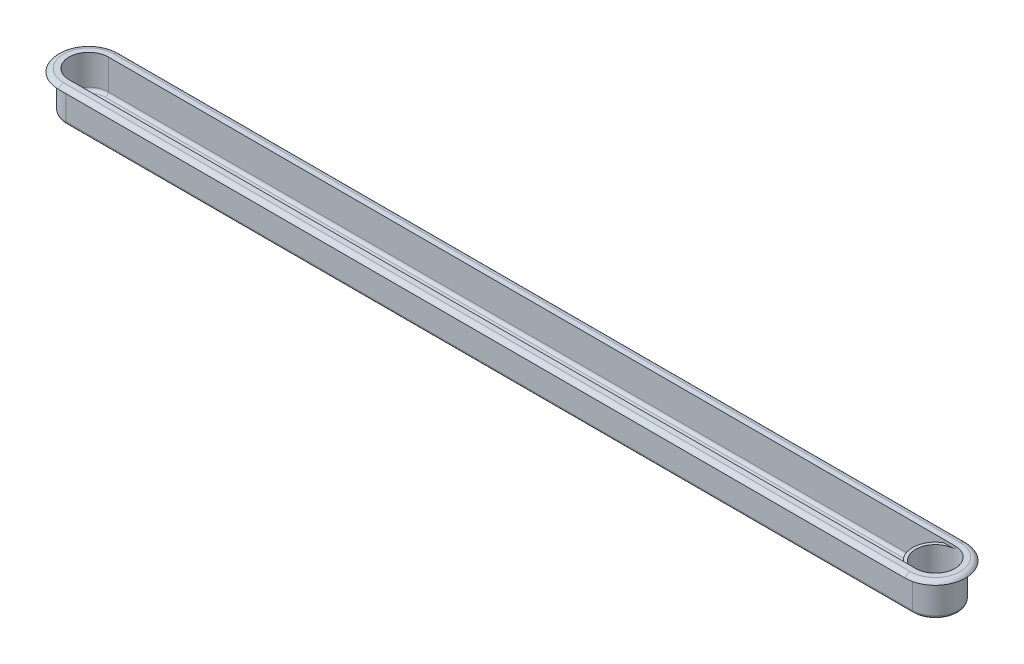
ISO-10303-21;
HEADER;
FILE_DESCRIPTION(('STEP AP214'),'2;1');
FILE_NAME('part.step','',(''),(''),'','','');
FILE_SCHEMA(('AUTOMOTIVE_DESIGN { 1 0 10303 214 1 1 1 1 }'));
ENDSEC;
DATA;
#1=APPLICATION_CONTEXT('core data for automotive mechanical design processes');
#2=APPLICATION_PROTOCOL_DEFINITION('international standard','automotive_design',2000,#1);
#3=PRODUCT_CONTEXT('',#1,'mechanical');
#4=PRODUCT('Part','Part','',(#3));
#5=PRODUCT_RELATED_PRODUCT_CATEGORY('part','',(#4));
#6=PRODUCT_DEFINITION_FORMATION('','',#4);
#7=PRODUCT_DEFINITION_CONTEXT('part definition',#1,'design');
#8=PRODUCT_DEFINITION('design','',#6,#7);
#9=PRODUCT_DEFINITION_SHAPE('','',#8);
#10=(LENGTH_UNIT() NAMED_UNIT(*) SI_UNIT(.MILLI.,.METRE.));
#11=(NAMED_UNIT(*) PLANE_ANGLE_UNIT() SI_UNIT($,.RADIAN.));
#12=(NAMED_UNIT(*) SI_UNIT($,.STERADIAN.) SOLID_ANGLE_UNIT());
#13=UNCERTAINTY_MEASURE_WITH_UNIT(LENGTH_MEASURE(1.E-05),#10,'distance_accuracy_value','');
#14=(GEOMETRIC_REPRESENTATION_CONTEXT(3) GLOBAL_UNCERTAINTY_ASSIGNED_CONTEXT((#13)) GLOBAL_UNIT_ASSIGNED_CONTEXT((#10,
#11,#12)) REPRESENTATION_CONTEXT('',''));
#15=CARTESIAN_POINT('',(0.,0.,0.));
#16=DIRECTION('',(0.,0.,1.));
#17=DIRECTION('',(1.,0.,0.));
#18=AXIS2_PLACEMENT_3D('',#15,#16,#17);
#19=CARTESIAN_POINT('',(140.,11.5,0.));
#20=DIRECTION('',(0.,1.,0.));
#21=DIRECTION('',(0.,0.,1.));
#22=AXIS2_PLACEMENT_3D('',#19,#20,#21);
#23=PLANE('',#22);
#24=CARTESIAN_POINT('',(140.,11.5,0.));
#25=DIRECTION('',(0.,-1.,0.));
#26=DIRECTION('',(0.,0.,1.));
#27=AXIS2_PLACEMENT_3D('',#24,#25,#26);
#28=CIRCLE('',#27,7.50000000000001);
#29=CARTESIAN_POINT('',(136.258342613226,11.5,6.49999999999997));
#30=VERTEX_POINT('',#29);
#31=CARTESIAN_POINT('',(136.258342613226,11.5,-6.49999999999997));
#32=VERTEX_POINT('',#31);
#33=EDGE_CURVE('E269',#30,#32,#28,.T.);
#34=ORIENTED_EDGE('',*,*,#33,.F.);
#35=DIRECTION('',(1.,0.,0.));
#36=VECTOR('',#35,1.);
#37=CARTESIAN_POINT('',(140.,11.5,6.5));
#38=LINE('',#37,#36);
#39=CARTESIAN_POINT('',(140.,11.5,6.5));
#40=VERTEX_POINT('',#39);
#41=EDGE_CURVE('E242',#30,#40,#38,.T.);
#42=ORIENTED_EDGE('',*,*,#41,.T.);
#43=CARTESIAN_POINT('',(140.,11.5,0.));
#44=DIRECTION('',(0.,1.,0.));
#45=DIRECTION('',(0.,0.,1.));
#46=AXIS2_PLACEMENT_3D('',#43,#44,#45);
#47=CIRCLE('',#46,6.49999999999999);
#48=CARTESIAN_POINT('',(140.,11.5,-6.49999999999997));
#49=VERTEX_POINT('',#48);
#50=EDGE_CURVE('E265',#49,#40,#47,.T.);
#51=ORIENTED_EDGE('',*,*,#50,.F.);
#52=DIRECTION('',(-1.,0.,0.));
#53=VECTOR('',#52,1.);
#54=CARTESIAN_POINT('',(136.258342613226,11.5,-6.49999999999997));
#55=LINE('',#54,#53);
#56=EDGE_CURVE('E233',#49,#32,#55,.T.);
#57=ORIENTED_EDGE('',*,*,#56,.T.);
#58=EDGE_LOOP('',(#34,#42,#51,#57));
#59=FACE_BOUND('',#58,.T.);
#60=ADVANCED_FACE('F37',(#59),#23,.T.);
#61=CARTESIAN_POINT('',(-140.,11.5,0.));
#62=DIRECTION('',(0.,-1.,0.));
#63=DIRECTION('',(0.,0.,-1.));
#64=AXIS2_PLACEMENT_3D('',#61,#62,#63);
#65=CYLINDRICAL_SURFACE('',#64,6.49999999999997);
#66=DIRECTION('',(0.,-1.,0.));
#67=VECTOR('',#66,1.);
#68=CARTESIAN_POINT('',(-140.,11.5,6.49999999999997));
#69=LINE('',#68,#67);
#70=CARTESIAN_POINT('',(-140.,12.5,6.49999999999997));
#71=VERTEX_POINT('',#70);
#72=CARTESIAN_POINT('',(-140.,2.5,6.49999999999997));
#73=VERTEX_POINT('',#72);
#74=EDGE_CURVE('E283',#71,#73,#69,.T.);
#75=ORIENTED_EDGE('',*,*,#74,.T.);
#76=CARTESIAN_POINT('',(-140.,2.5,0.));
#77=DIRECTION('',(0.,1.,0.));
#78=DIRECTION('',(0.,0.,1.));
#79=AXIS2_PLACEMENT_3D('',#76,#77,#78);
#80=CIRCLE('',#79,6.49999999999997);
#81=CARTESIAN_POINT('',(-140.,2.5,-6.49999999999997));
#82=VERTEX_POINT('',#81);
#83=EDGE_CURVE('E47',#73,#82,#80,.F.);
#84=ORIENTED_EDGE('',*,*,#83,.T.);
#85=DIRECTION('',(0.,-1.,0.));
#86=VECTOR('',#85,1.);
#87=CARTESIAN_POINT('',(-140.,11.5,-6.49999999999997));
#88=LINE('',#87,#86);
#89=CARTESIAN_POINT('',(-140.,12.5,-6.49999999999997));
#90=VERTEX_POINT('',#89);
#91=EDGE_CURVE('E272',#90,#82,#88,.T.);
#92=ORIENTED_EDGE('',*,*,#91,.F.);
#93=CARTESIAN_POINT('',(-140.,12.5,0.));
#94=DIRECTION('',(0.,1.,0.));
#95=DIRECTION('',(0.,0.,1.));
#96=AXIS2_PLACEMENT_3D('',#93,#94,#95);
#97=CIRCLE('',#96,6.49999999999997);
#98=EDGE_CURVE('E229',#90,#71,#97,.T.);
#99=ORIENTED_EDGE('',*,*,#98,.T.);
#100=EDGE_LOOP('',(#75,#84,#92,#99));
#101=FACE_BOUND('',#100,.T.);
#102=ADVANCED_FACE('F390',(#101),#65,.F.);
#103=CARTESIAN_POINT('',(-140.,11.5,6.49999999999997));
#104=DIRECTION('',(0.,0.,-1.));
#105=DIRECTION('',(-1.,0.,0.));
#106=AXIS2_PLACEMENT_3D('',#103,#104,#105);
#107=PLANE('',#106);
#108=DIRECTION('',(0.,-1.,0.));
#109=VECTOR('',#108,1.);
#110=CARTESIAN_POINT('',(136.258342613226,11.5,6.49999999999997));
#111=LINE('',#110,#109);
#112=CARTESIAN_POINT('',(136.258342613226,2.5,6.49999999999997));
#113=VERTEX_POINT('',#112);
#114=EDGE_CURVE('E280',#30,#113,#111,.T.);
#115=ORIENTED_EDGE('',*,*,#114,.T.);
#116=DIRECTION('',(1.,0.,0.));
#117=VECTOR('',#116,1.);
#118=CARTESIAN_POINT('',(-140.,2.5,6.49999999999997));
#119=LINE('',#118,#117);
#120=EDGE_CURVE('E477',#113,#73,#119,.F.);
#121=ORIENTED_EDGE('',*,*,#120,.T.);
#122=ORIENTED_EDGE('',*,*,#74,.F.);
#123=DIRECTION('',(1.,0.,0.));
#124=VECTOR('',#123,1.);
#125=CARTESIAN_POINT('',(-140.,12.5,6.49999999999997));
#126=LINE('',#125,#124);
#127=CARTESIAN_POINT('',(140.,12.5,6.5));
#128=VERTEX_POINT('',#127);
#129=EDGE_CURVE('E232',#71,#128,#126,.T.);
#130=ORIENTED_EDGE('',*,*,#129,.T.);
#131=DIRECTION('',(0.,-1.,0.));
#132=VECTOR('',#131,1.);
#133=CARTESIAN_POINT('',(140.,12.5,6.5));
#134=LINE('',#133,#132);
#135=EDGE_CURVE('E251',#128,#40,#134,.T.);
#136=ORIENTED_EDGE('',*,*,#135,.T.);
#137=ORIENTED_EDGE('',*,*,#41,.F.);
#138=EDGE_LOOP('',(#115,#121,#122,#130,#136,#137));
#139=FACE_BOUND('',#138,.T.);
#140=ADVANCED_FACE('F384',(#139),#107,.T.);
#141=CARTESIAN_POINT('',(140.,11.5,0.));
#142=DIRECTION('',(0.,-1.,0.));
#143=DIRECTION('',(0.,0.,-1.));
#144=AXIS2_PLACEMENT_3D('',#141,#142,#143);
#145=CYLINDRICAL_SURFACE('',#144,7.50000000000001);
#146=CARTESIAN_POINT('',(140.,1.5,0.));
#147=DIRECTION('',(0.,-1.,0.));
#148=DIRECTION('',(0.,0.,1.));
#149=AXIS2_PLACEMENT_3D('',#146,#147,#148);
#150=CIRCLE('',#149,7.50000000000001);
#151=CARTESIAN_POINT('',(134.900980486407,1.5,5.49999999999997));
#152=VERTEX_POINT('',#151);
#153=CARTESIAN_POINT('',(134.900980486407,1.5,-5.49999999999996));
#154=VERTEX_POINT('',#153);
#155=EDGE_CURVE('E268',#152,#154,#150,.T.);
#156=ORIENTED_EDGE('',*,*,#155,.F.);
#157=CARTESIAN_POINT('',(134.900980486407,1.5,5.49999999999997));
#158=CARTESIAN_POINT('',(134.946952291994,1.50002003650712,5.54262898673052));
#159=CARTESIAN_POINT('',(134.993445189555,1.50272504794038,5.58465170248606));
#160=CARTESIAN_POINT('',(135.087137466338,1.51320124060883,5.66724411827812));
#161=CARTESIAN_POINT('',(135.134336734867,1.5209716360291,5.70781404266275));
#162=CARTESIAN_POINT('',(135.229652092631,1.54138887863084,5.78771940563766));
#163=CARTESIAN_POINT('',(135.277772527232,1.55408944555912,5.82703589323914));
#164=CARTESIAN_POINT('',(135.374035633167,1.58420334133465,5.90374879192079));
#165=CARTESIAN_POINT('',(135.422178302356,1.60161628392711,5.94114536007041));
#166=CARTESIAN_POINT('',(135.54894823866,1.65380713672029,6.0372056326595));
#167=CARTESIAN_POINT('',(135.627338781558,1.69256190836863,6.0941390696333));
#168=CARTESIAN_POINT('',(135.742123230162,1.76077011162972,6.17435612255911));
#169=CARTESIAN_POINT('',(135.779838618358,1.78512153964702,6.200180588177));
#170=CARTESIAN_POINT('',(135.853906229219,1.83751917937633,6.24995092689734));
#171=CARTESIAN_POINT('',(135.890259488867,1.86556250390343,6.27389824488112));
#172=CARTESIAN_POINT('',(135.95671580884,1.9222579204163,6.31690046652232));
#173=CARTESIAN_POINT('',(135.987050884968,1.95044980439645,6.33619945161649));
#174=CARTESIAN_POINT('',(136.045361556525,2.01057411495382,6.3727559931852));
#175=CARTESIAN_POINT('',(136.07333189791,2.04251451286589,6.39000903645319));
#176=CARTESIAN_POINT('',(136.125950793258,2.11105235054671,6.42204815937765));
#177=CARTESIAN_POINT('',(136.150547181356,2.14770889223293,6.4367961915622));
#178=CARTESIAN_POINT('',(136.19373252189,2.22543123779643,6.46242652811217));
#179=CARTESIAN_POINT('',(136.212364240135,2.26646270597091,6.47333641001888));
#180=CARTESIAN_POINT('',(136.236737525985,2.33959183820559,6.48752609439693));
#181=CARTESIAN_POINT('',(136.244668422101,2.37068466011413,6.49211248537183));
#182=CARTESIAN_POINT('',(136.2527819256,2.41840287412194,6.49679660159349));
#183=CARTESIAN_POINT('',(136.254856878438,2.43461214394016,6.49799253767643));
#184=CARTESIAN_POINT('',(136.257641272943,2.46721063515719,6.49959631835286));
#185=CARTESIAN_POINT('',(136.258348608515,2.48360009507704,6.50000294743848));
#186=CARTESIAN_POINT('',(136.258342613226,2.5,6.49999999999997));
#187=B_SPLINE_CURVE_WITH_KNOTS('',3,(#157,#158,#159,#160,#161,#162,#163,#164,#165,#166,#167,
#168,#169,#170,#171,#172,#173,#174,#175,#176,#177,#178,#179,#180,#181,#182,#183,#184,#185,#186),
.UNSPECIFIED.,.F.,.F.,(4,2,2,2,2,2,2,2,2,2,2,2,2,2,4),(0.,0.187977721771527,0.375926288683914,
0.565983005401975,0.756024148638628,1.06786002140546,1.22310249235813,1.37822427185635,
1.51508684601939,1.65224592440766,1.7913311974802,1.92939567390316,2.02610998498491,
2.07519505258932,2.12435564986707),.UNSPECIFIED.);
#188=EDGE_CURVE('E371',#152,#113,#187,.T.);
#189=ORIENTED_EDGE('',*,*,#188,.T.);
#190=ORIENTED_EDGE('',*,*,#114,.F.);
#191=ORIENTED_EDGE('',*,*,#33,.T.);
#192=DIRECTION('',(0.,-1.,0.));
#193=VECTOR('',#192,1.);
#194=CARTESIAN_POINT('',(136.258342613226,11.5,-6.49999999999997));
#195=LINE('',#194,#193);
#196=CARTESIAN_POINT('',(136.258342613226,2.5,-6.49999999999997));
#197=VERTEX_POINT('',#196);
#198=EDGE_CURVE('E277',#32,#197,#195,.T.);
#199=ORIENTED_EDGE('',*,*,#198,.T.);
#200=CARTESIAN_POINT('',(136.258342613226,2.5,-6.49999999999997));
#201=CARTESIAN_POINT('',(136.25841792369,2.46928998727029,-6.5000374897446));
#202=CARTESIAN_POINT('',(136.255888256761,2.43869251118986,-6.49858745557396));
#203=CARTESIAN_POINT('',(136.246321658076,2.37881289931863,-6.49306922810718));
#204=CARTESIAN_POINT('',(136.239338686928,2.34951944826787,-6.48903237645842));
#205=CARTESIAN_POINT('',(136.219178495618,2.28502184992641,-6.47731019771003));
#206=CARTESIAN_POINT('',(136.204849642786,2.25031056964902,-6.46894118822808));
#207=CARTESIAN_POINT('',(136.171655542048,2.18387396589547,-6.44935308174181));
#208=CARTESIAN_POINT('',(136.152767197899,2.1521650274877,-6.43811945705791));
#209=CARTESIAN_POINT('',(136.099275543016,2.07328753220991,-6.40592035882745));
#210=CARTESIAN_POINT('',(136.062141130737,2.02857167273367,-6.38321296358818));
#211=CARTESIAN_POINT('',(135.983265212832,1.94595594862863,-6.33387946587137));
#212=CARTESIAN_POINT('',(135.941513154215,1.90807223981119,-6.3072443388297));
#213=CARTESIAN_POINT('',(135.860718751733,1.84249392703065,-6.25446888297825));
#214=CARTESIAN_POINT('',(135.821990622433,1.81411756673584,-6.22868331927618));
#215=CARTESIAN_POINT('',(135.743219115954,1.76133376599502,-6.17511905170644));
#216=CARTESIAN_POINT('',(135.703174846908,1.73692908645731,-6.14733898052949));
#217=CARTESIAN_POINT('',(135.581766442687,1.669141217856,-6.06127143496727));
#218=CARTESIAN_POINT('',(135.499178822603,1.63122428536937,-6.00029030743707));
#219=CARTESIAN_POINT('',(135.372920540882,1.58396201036063,-5.90281165735844));
#220=CARTESIAN_POINT('',(135.329376926202,1.5695961773513,-5.86842532842453));
#221=CARTESIAN_POINT('',(135.242391670056,1.54474546033107,-5.79812740143581));
#222=CARTESIAN_POINT('',(135.198950023901,1.53426039424039,-5.76221587502914));
#223=CARTESIAN_POINT('',(135.112716332713,1.51736237078483,-5.68925526954894));
#224=CARTESIAN_POINT('',(135.069921908525,1.51092373573531,-5.65221496027261));
#225=CARTESIAN_POINT('',(134.984934723896,1.50224867345782,-5.57694900722814));
#226=CARTESIAN_POINT('',(134.942742147279,1.50001350392638,-5.53872301217368));
#227=CARTESIAN_POINT('',(134.900980486407,1.5,-5.49999999999994));
#228=B_SPLINE_CURVE_WITH_KNOTS('',3,(#200,#201,#202,#203,#204,#205,#206,#207,#208,#209,#210,
#211,#212,#213,#214,#215,#216,#217,#218,#219,#220,#221,#222,#223,#224,#225,#226,#227),
.UNSPECIFIED.,.F.,.F.,(4,2,2,2,2,2,2,2,2,2,2,2,2,4),(0.,0.0918102616019271,0.182528665881996,
0.297306955274602,0.412679330468151,0.598844916694911,0.785445111116763,0.948706934309549,
1.11208176838381,1.43905073809234,1.61088519286762,1.78271158440525,1.95343629477279,
2.12421207864932),.UNSPECIFIED.);
#229=EDGE_CURVE('E364',#197,#154,#228,.T.);
#230=ORIENTED_EDGE('',*,*,#229,.T.);
#231=EDGE_LOOP('',(#156,#189,#190,#191,#199,#230));
#232=FACE_BOUND('',#231,.T.);
#233=ADVANCED_FACE('F378',(#232),#145,.T.);
#234=CARTESIAN_POINT('',(-140.,11.5,-6.49999999999997));
#235=DIRECTION('',(0.,0.,1.));
#236=DIRECTION('',(1.,0.,0.));
#237=AXIS2_PLACEMENT_3D('',#234,#235,#236);
#238=PLANE('',#237);
#239=ORIENTED_EDGE('',*,*,#91,.T.);
#240=DIRECTION('',(-1.,0.,0.));
#241=VECTOR('',#240,1.);
#242=CARTESIAN_POINT('',(136.258342613226,2.5,-6.49999999999997));
#243=LINE('',#242,#241);
#244=EDGE_CURVE('E11',#82,#197,#243,.F.);
#245=ORIENTED_EDGE('',*,*,#244,.T.);
#246=ORIENTED_EDGE('',*,*,#198,.F.);
#247=ORIENTED_EDGE('',*,*,#56,.F.);
#248=DIRECTION('',(0.,-1.,0.));
#249=VECTOR('',#248,1.);
#250=CARTESIAN_POINT('',(140.,12.5,-6.49999999999997));
#251=LINE('',#250,#249);
#252=CARTESIAN_POINT('',(140.,12.5,-6.49999999999997));
#253=VERTEX_POINT('',#252);
#254=EDGE_CURVE('E241',#253,#49,#251,.T.);
#255=ORIENTED_EDGE('',*,*,#254,.F.);
#256=DIRECTION('',(-1.,0.,0.));
#257=VECTOR('',#256,1.);
#258=CARTESIAN_POINT('',(140.,12.5,-6.49999999999997));
#259=LINE('',#258,#257);
#260=EDGE_CURVE('E238',#253,#90,#259,.T.);
#261=ORIENTED_EDGE('',*,*,#260,.T.);
#262=EDGE_LOOP('',(#239,#245,#246,#247,#255,#261));
#263=FACE_BOUND('',#262,.T.);
#264=ADVANCED_FACE('F383',(#263),#238,.T.);
#265=CARTESIAN_POINT('',(140.,11.5,0.));
#266=DIRECTION('',(0.,-1.,0.));
#267=DIRECTION('',(0.,0.,-1.));
#268=AXIS2_PLACEMENT_3D('',#265,#266,#267);
#269=CYLINDRICAL_SURFACE('',#268,6.49999999999999);
#270=ORIENTED_EDGE('',*,*,#50,.T.);
#271=ORIENTED_EDGE('',*,*,#135,.F.);
#272=CARTESIAN_POINT('',(140.,12.5,0.));
#273=DIRECTION('',(0.,1.,0.));
#274=DIRECTION('',(0.,0.,1.));
#275=AXIS2_PLACEMENT_3D('',#272,#273,#274);
#276=CIRCLE('',#275,6.49999999999999);
#277=EDGE_CURVE('E235',#128,#253,#276,.T.);
#278=ORIENTED_EDGE('',*,*,#277,.T.);
#279=ORIENTED_EDGE('',*,*,#254,.T.);
#280=EDGE_LOOP('',(#270,#271,#278,#279));
#281=FACE_BOUND('',#280,.T.);
#282=CARTESIAN_POINT('',(140.,1.5,0.));
#283=DIRECTION('',(0.,1.,0.));
#284=DIRECTION('',(0.,0.,1.));
#285=AXIS2_PLACEMENT_3D('',#282,#283,#284);
#286=CIRCLE('',#285,6.49999999999999);
#287=CARTESIAN_POINT('',(140.,1.5,6.5));
#288=VERTEX_POINT('',#287);
#289=EDGE_CURVE('E246',#288,#288,#286,.F.);
#290=ORIENTED_EDGE('',*,*,#289,.T.);
#291=EDGE_LOOP('',(#290));
#292=FACE_BOUND('',#291,.T.);
#293=ADVANCED_FACE('F484',(#281,#292),#269,.F.);
#294=CARTESIAN_POINT('',(-140.,1.5,0.));
#295=DIRECTION('',(0.,1.,0.));
#296=DIRECTION('',(0.,0.,1.));
#297=AXIS2_PLACEMENT_3D('',#294,#295,#296);
#298=PLANE('',#297);
#299=CARTESIAN_POINT('',(140.,1.5,0.));
#300=DIRECTION('',(0.,1.,0.));
#301=DIRECTION('',(0.,0.,1.));
#302=AXIS2_PLACEMENT_3D('',#299,#300,#301);
#303=CIRCLE('',#302,0.750000000000012);
#304=CARTESIAN_POINT('',(140.,1.5,0.750000000000029));
#305=VERTEX_POINT('',#304);
#306=EDGE_CURVE('E212',#305,#305,#303,.T.);
#307=ORIENTED_EDGE('',*,*,#306,.F.);
#308=EDGE_LOOP('',(#307));
#309=FACE_BOUND('',#308,.T.);
#310=ORIENTED_EDGE('',*,*,#289,.F.);
#311=EDGE_LOOP('',(#310));
#312=FACE_BOUND('',#311,.T.);
#313=ADVANCED_FACE('F402',(#309,#312),#298,.T.);
#314=CARTESIAN_POINT('',(-123.5,1.5,0.));
#315=DIRECTION('',(0.,1.,0.));
#316=DIRECTION('',(0.,0.,-1.));
#317=AXIS2_PLACEMENT_3D('',#314,#315,#316);
#318=CIRCLE('',#317,3.50000000000003);
#319=CARTESIAN_POINT('',(-123.5,1.5,-3.50000000000003));
#320=VERTEX_POINT('',#319);
#321=CARTESIAN_POINT('',(-123.5,1.5,3.50000000000003));
#322=VERTEX_POINT('',#321);
#323=EDGE_CURVE('E55',#320,#322,#318,.T.);
#324=ORIENTED_EDGE('',*,*,#323,.F.);
#325=DIRECTION('',(-1.,0.,0.));
#326=VECTOR('',#325,1.);
#327=CARTESIAN_POINT('',(-123.5,1.5,-3.50000000000003));
#328=LINE('',#327,#326);
#329=CARTESIAN_POINT('',(-103.5,1.5,-3.50000000000003));
#330=VERTEX_POINT('',#329);
#331=EDGE_CURVE('E206',#330,#320,#328,.T.);
#332=ORIENTED_EDGE('',*,*,#331,.F.);
#333=CARTESIAN_POINT('',(-103.5,1.5,0.));
#334=DIRECTION('',(0.,1.,0.));
#335=DIRECTION('',(0.,0.,-1.));
#336=AXIS2_PLACEMENT_3D('',#333,#334,#335);
#337=CIRCLE('',#336,3.50000000000003);
#338=CARTESIAN_POINT('',(-103.5,1.5,3.50000000000006));
#339=VERTEX_POINT('',#338);
#340=EDGE_CURVE('E209',#339,#330,#337,.T.);
#341=ORIENTED_EDGE('',*,*,#340,.F.);
#342=DIRECTION('',(1.,0.,0.));
#343=VECTOR('',#342,1.);
#344=CARTESIAN_POINT('',(-103.5,1.5,3.50000000000003));
#345=LINE('',#344,#343);
#346=EDGE_CURVE('E218',#322,#339,#345,.T.);
#347=ORIENTED_EDGE('',*,*,#346,.F.);
#348=EDGE_LOOP('',(#324,#332,#341,#347));
#349=FACE_BOUND('',#348,.T.);
#350=CARTESIAN_POINT('',(-140.,1.5,0.));
#351=DIRECTION('',(0.,1.,0.));
#352=DIRECTION('',(0.,0.,1.));
#353=AXIS2_PLACEMENT_3D('',#350,#351,#352);
#354=CIRCLE('',#353,5.49999999999997);
#355=CARTESIAN_POINT('',(-140.,1.5,-5.49999999999997));
#356=VERTEX_POINT('',#355);
#357=CARTESIAN_POINT('',(-140.,1.5,5.49999999999998));
#358=VERTEX_POINT('',#357);
#359=EDGE_CURVE('E359',#356,#358,#354,.T.);
#360=ORIENTED_EDGE('',*,*,#359,.T.);
#361=DIRECTION('',(1.,0.,0.));
#362=VECTOR('',#361,1.);
#363=CARTESIAN_POINT('',(136.258342613226,1.5,5.49999999999997));
#364=LINE('',#363,#362);
#365=EDGE_CURVE('E361',#358,#152,#364,.T.);
#366=ORIENTED_EDGE('',*,*,#365,.T.);
#367=ORIENTED_EDGE('',*,*,#155,.T.);
#368=DIRECTION('',(-1.,0.,0.));
#369=VECTOR('',#368,1.);
#370=CARTESIAN_POINT('',(-140.,1.5,-5.49999999999997));
#371=LINE('',#370,#369);
#372=EDGE_CURVE('E348',#154,#356,#371,.T.);
#373=ORIENTED_EDGE('',*,*,#372,.T.);
#374=EDGE_LOOP('',(#360,#366,#367,#373));
#375=FACE_BOUND('',#374,.T.);
#376=ADVANCED_FACE('F398',(#349,#375),#298,.T.);
#377=CARTESIAN_POINT('',(-140.,11.5,0.));
#378=DIRECTION('',(0.,1.,0.));
#379=DIRECTION('',(0.,0.,1.));
#380=AXIS2_PLACEMENT_3D('',#377,#378,#379);
#381=PLANE('',#380);
#382=CARTESIAN_POINT('',(-140.,11.5,0.));
#383=DIRECTION('',(0.,1.,0.));
#384=DIRECTION('',(0.,0.,1.));
#385=AXIS2_PLACEMENT_3D('',#382,#383,#384);
#386=CIRCLE('',#385,9.99999999999996);
#387=CARTESIAN_POINT('',(-140.,11.5,-9.99999999999996));
#388=VERTEX_POINT('',#387);
#389=CARTESIAN_POINT('',(-140.,11.5,9.99999999999996));
#390=VERTEX_POINT('',#389);
#391=EDGE_CURVE('E253',#388,#390,#386,.T.);
#392=ORIENTED_EDGE('',*,*,#391,.F.);
#393=DIRECTION('',(-1.,0.,0.));
#394=VECTOR('',#393,1.);
#395=CARTESIAN_POINT('',(-140.,11.5,-9.99999999999996));
#396=LINE('',#395,#394);
#397=CARTESIAN_POINT('',(140.,11.5,-9.99999999999996));
#398=VERTEX_POINT('',#397);
#399=EDGE_CURVE('E262',#398,#388,#396,.T.);
#400=ORIENTED_EDGE('',*,*,#399,.F.);
#401=CARTESIAN_POINT('',(140.,11.5,0.));
#402=DIRECTION('',(0.,1.,0.));
#403=DIRECTION('',(0.,0.,-1.));
#404=AXIS2_PLACEMENT_3D('',#401,#402,#403);
#405=CIRCLE('',#404,9.99999999999996);
#406=CARTESIAN_POINT('',(140.,11.5,9.99999999999998));
#407=VERTEX_POINT('',#406);
#408=EDGE_CURVE('E259',#407,#398,#405,.T.);
#409=ORIENTED_EDGE('',*,*,#408,.F.);
#410=DIRECTION('',(1.,0.,0.));
#411=VECTOR('',#410,1.);
#412=CARTESIAN_POINT('',(140.,11.5,9.99999999999996));
#413=LINE('',#412,#411);
#414=EDGE_CURVE('E256',#390,#407,#413,.T.);
#415=ORIENTED_EDGE('',*,*,#414,.F.);
#416=EDGE_LOOP('',(#392,#400,#409,#415));
#417=FACE_BOUND('',#416,.T.);
#418=DIRECTION('',(1.,0.,0.));
#419=VECTOR('',#418,1.);
#420=CARTESIAN_POINT('',(-140.,11.5,7.5));
#421=LINE('',#420,#419);
#422=CARTESIAN_POINT('',(-140.,11.5,7.5));
#423=VERTEX_POINT('',#422);
#424=CARTESIAN_POINT('',(140.,11.5,7.50000000000002));
#425=VERTEX_POINT('',#424);
#426=EDGE_CURVE('E295',#423,#425,#421,.T.);
#427=ORIENTED_EDGE('',*,*,#426,.T.);
#428=CARTESIAN_POINT('',(140.,11.5,0.));
#429=DIRECTION('',(0.,1.,0.));
#430=DIRECTION('',(0.,0.,1.));
#431=AXIS2_PLACEMENT_3D('',#428,#429,#430);
#432=CIRCLE('',#431,7.50000000000001);
#433=CARTESIAN_POINT('',(140.,11.5,-7.5));
#434=VERTEX_POINT('',#433);
#435=EDGE_CURVE('E286',#425,#434,#432,.T.);
#436=ORIENTED_EDGE('',*,*,#435,.T.);
#437=DIRECTION('',(-1.,0.,0.));
#438=VECTOR('',#437,1.);
#439=CARTESIAN_POINT('',(140.,11.5,-7.5));
#440=LINE('',#439,#438);
#441=CARTESIAN_POINT('',(-140.,11.5,-7.49999999999998));
#442=VERTEX_POINT('',#441);
#443=EDGE_CURVE('E289',#434,#442,#440,.T.);
#444=ORIENTED_EDGE('',*,*,#443,.T.);
#445=CARTESIAN_POINT('',(-140.,11.5,0.));
#446=DIRECTION('',(0.,1.,0.));
#447=DIRECTION('',(0.,0.,1.));
#448=AXIS2_PLACEMENT_3D('',#445,#446,#447);
#449=CIRCLE('',#448,7.5);
#450=EDGE_CURVE('E292',#442,#423,#449,.T.);
#451=ORIENTED_EDGE('',*,*,#450,.T.);
#452=EDGE_LOOP('',(#427,#436,#444,#451));
#453=FACE_BOUND('',#452,.T.);
#454=ADVANCED_FACE('F401',(#417,#453),#381,.F.);
#455=CARTESIAN_POINT('',(-140.,12.5,0.));
#456=DIRECTION('',(0.,1.,0.));
#457=DIRECTION('',(0.,0.,1.));
#458=AXIS2_PLACEMENT_3D('',#455,#456,#457);
#459=PLANE('',#458);
#460=DIRECTION('',(1.,0.,0.));
#461=VECTOR('',#460,1.);
#462=CARTESIAN_POINT('',(-140.,12.5,-8.26794919243109));
#463=LINE('',#462,#461);
#464=CARTESIAN_POINT('',(140.,12.5,-8.26794919243109));
#465=VERTEX_POINT('',#464);
#466=CARTESIAN_POINT('',(-140.,12.5,-8.26794919243109));
#467=VERTEX_POINT('',#466);
#468=EDGE_CURVE('E245',#465,#467,#463,.F.);
#469=ORIENTED_EDGE('',*,*,#468,.T.);
#470=CARTESIAN_POINT('',(-140.,12.5,0.));
#471=DIRECTION('',(0.,1.,0.));
#472=DIRECTION('',(0.,0.,1.));
#473=AXIS2_PLACEMENT_3D('',#470,#471,#472);
#474=CIRCLE('',#473,8.26794919243109);
#475=CARTESIAN_POINT('',(-140.,12.5,8.26794919243109));
#476=VERTEX_POINT('',#475);
#477=EDGE_CURVE('E317',#467,#476,#474,.T.);
#478=ORIENTED_EDGE('',*,*,#477,.T.);
#479=DIRECTION('',(-1.,0.,0.));
#480=VECTOR('',#479,1.);
#481=CARTESIAN_POINT('',(140.,12.5,8.26794919243109));
#482=LINE('',#481,#480);
#483=CARTESIAN_POINT('',(140.,12.5,8.2679491924311));
#484=VERTEX_POINT('',#483);
#485=EDGE_CURVE('E315',#476,#484,#482,.F.);
#486=ORIENTED_EDGE('',*,*,#485,.T.);
#487=CARTESIAN_POINT('',(140.,12.5,0.));
#488=DIRECTION('',(0.,1.,0.));
#489=DIRECTION('',(0.,0.,1.));
#490=AXIS2_PLACEMENT_3D('',#487,#488,#489);
#491=CIRCLE('',#490,8.26794919243109);
#492=EDGE_CURVE('E313',#484,#465,#491,.T.);
#493=ORIENTED_EDGE('',*,*,#492,.T.);
#494=EDGE_LOOP('',(#469,#478,#486,#493));
#495=FACE_BOUND('',#494,.T.);
#496=ORIENTED_EDGE('',*,*,#129,.F.);
#497=ORIENTED_EDGE('',*,*,#98,.F.);
#498=ORIENTED_EDGE('',*,*,#260,.F.);
#499=ORIENTED_EDGE('',*,*,#277,.F.);
#500=EDGE_LOOP('',(#496,#497,#498,#499));
#501=FACE_BOUND('',#500,.T.);
#502=ADVANCED_FACE('F407',(#495,#501),#459,.T.);
#503=CARTESIAN_POINT('',(-140.,0.,0.));
#504=DIRECTION('',(0.,1.,0.));
#505=DIRECTION('',(0.,0.,1.));
#506=AXIS2_PLACEMENT_3D('',#503,#504,#505);
#507=PLANE('',#506);
#508=CARTESIAN_POINT('',(140.,0.,0.));
#509=DIRECTION('',(0.,1.,0.));
#510=DIRECTION('',(0.,0.,1.));
#511=AXIS2_PLACEMENT_3D('',#508,#509,#510);
#512=CIRCLE('',#511,0.750000000000012);
#513=CARTESIAN_POINT('',(140.,0.,0.750000000000029));
#514=VERTEX_POINT('',#513);
#515=EDGE_CURVE('E219',#514,#514,#512,.T.);
#516=ORIENTED_EDGE('',*,*,#515,.T.);
#517=EDGE_LOOP('',(#516));
#518=FACE_BOUND('',#517,.T.);
#519=DIRECTION('',(-1.,0.,0.));
#520=VECTOR('',#519,1.);
#521=CARTESIAN_POINT('',(-123.5,0.,-3.50000000000003));
#522=LINE('',#521,#520);
#523=CARTESIAN_POINT('',(-103.5,0.,-3.50000000000003));
#524=VERTEX_POINT('',#523);
#525=CARTESIAN_POINT('',(-123.5,0.,-3.50000000000003));
#526=VERTEX_POINT('',#525);
#527=EDGE_CURVE('E196',#524,#526,#522,.T.);
#528=ORIENTED_EDGE('',*,*,#527,.T.);
#529=CARTESIAN_POINT('',(-123.5,0.,0.));
#530=DIRECTION('',(0.,1.,0.));
#531=DIRECTION('',(0.,0.,-1.));
#532=AXIS2_PLACEMENT_3D('',#529,#530,#531);
#533=CIRCLE('',#532,3.50000000000003);
#534=CARTESIAN_POINT('',(-123.5,0.,3.50000000000003));
#535=VERTEX_POINT('',#534);
#536=EDGE_CURVE('E190',#526,#535,#533,.T.);
#537=ORIENTED_EDGE('',*,*,#536,.T.);
#538=DIRECTION('',(1.,0.,0.));
#539=VECTOR('',#538,1.);
#540=CARTESIAN_POINT('',(-103.5,0.,3.50000000000003));
#541=LINE('',#540,#539);
#542=CARTESIAN_POINT('',(-103.5,0.,3.50000000000003));
#543=VERTEX_POINT('',#542);
#544=EDGE_CURVE('E199',#535,#543,#541,.T.);
#545=ORIENTED_EDGE('',*,*,#544,.T.);
#546=CARTESIAN_POINT('',(-103.5,0.,0.));
#547=DIRECTION('',(0.,1.,0.));
#548=DIRECTION('',(0.,0.,-1.));
#549=AXIS2_PLACEMENT_3D('',#546,#547,#548);
#550=CIRCLE('',#549,3.50000000000003);
#551=EDGE_CURVE('E63',#543,#524,#550,.T.);
#552=ORIENTED_EDGE('',*,*,#551,.T.);
#553=EDGE_LOOP('',(#528,#537,#545,#552));
#554=FACE_BOUND('',#553,.T.);
#555=DIRECTION('',(1.,0.,0.));
#556=VECTOR('',#555,1.);
#557=CARTESIAN_POINT('',(-140.,0.,6.5));
#558=LINE('',#557,#556);
#559=CARTESIAN_POINT('',(140.,0.,6.50000000000002));
#560=VERTEX_POINT('',#559);
#561=CARTESIAN_POINT('',(-140.,0.,6.5));
#562=VERTEX_POINT('',#561);
#563=EDGE_CURVE('E337',#560,#562,#558,.F.);
#564=ORIENTED_EDGE('',*,*,#563,.T.);
#565=CARTESIAN_POINT('',(-140.,0.,0.));
#566=DIRECTION('',(0.,1.,0.));
#567=DIRECTION('',(0.,0.,1.));
#568=AXIS2_PLACEMENT_3D('',#565,#566,#567);
#569=CIRCLE('',#568,6.5);
#570=CARTESIAN_POINT('',(-140.,0.,-6.5));
#571=VERTEX_POINT('',#570);
#572=EDGE_CURVE('E339',#562,#571,#569,.F.);
#573=ORIENTED_EDGE('',*,*,#572,.T.);
#574=DIRECTION('',(-1.,0.,0.));
#575=VECTOR('',#574,1.);
#576=CARTESIAN_POINT('',(-140.,0.,-6.5));
#577=LINE('',#576,#575);
#578=CARTESIAN_POINT('',(140.,0.,-6.5));
#579=VERTEX_POINT('',#578);
#580=EDGE_CURVE('E333',#571,#579,#577,.F.);
#581=ORIENTED_EDGE('',*,*,#580,.T.);
#582=CARTESIAN_POINT('',(140.,0.,0.));
#583=DIRECTION('',(0.,1.,0.));
#584=DIRECTION('',(0.,0.,1.));
#585=AXIS2_PLACEMENT_3D('',#582,#583,#584);
#586=CIRCLE('',#585,6.5);
#587=EDGE_CURVE('E335',#579,#560,#586,.F.);
#588=ORIENTED_EDGE('',*,*,#587,.T.);
#589=EDGE_LOOP('',(#564,#573,#581,#588));
#590=FACE_BOUND('',#589,.T.);
#591=ADVANCED_FACE('F203',(#518,#554,#590),#507,.F.);
#592=CARTESIAN_POINT('',(-140.,1.5,7.5));
#593=DIRECTION('',(0.,0.,-1.));
#594=DIRECTION('',(-1.,0.,0.));
#595=AXIS2_PLACEMENT_3D('',#592,#593,#594);
#596=PLANE('',#595);
#597=DIRECTION('',(0.,-1.,0.));
#598=VECTOR('',#597,1.);
#599=CARTESIAN_POINT('',(-140.,1.5,7.5));
#600=LINE('',#599,#598);
#601=CARTESIAN_POINT('',(-140.,1.,7.5));
#602=VERTEX_POINT('',#601);
#603=EDGE_CURVE('E307',#423,#602,#600,.T.);
#604=ORIENTED_EDGE('',*,*,#603,.T.);
#605=DIRECTION('',(1.,0.,0.));
#606=VECTOR('',#605,1.);
#607=CARTESIAN_POINT('',(-140.,1.,7.5));
#608=LINE('',#607,#606);
#609=CARTESIAN_POINT('',(140.,1.,7.50000000000002));
#610=VERTEX_POINT('',#609);
#611=EDGE_CURVE('E342',#602,#610,#608,.T.);
#612=ORIENTED_EDGE('',*,*,#611,.T.);
#613=DIRECTION('',(0.,-1.,0.));
#614=VECTOR('',#613,1.);
#615=CARTESIAN_POINT('',(140.,1.5,7.50000000000002));
#616=LINE('',#615,#614);
#617=EDGE_CURVE('E304',#425,#610,#616,.T.);
#618=ORIENTED_EDGE('',*,*,#617,.F.);
#619=ORIENTED_EDGE('',*,*,#426,.F.);
#620=EDGE_LOOP('',(#604,#612,#618,#619));
#621=FACE_BOUND('',#620,.T.);
#622=ADVANCED_FACE('F406',(#621),#596,.F.);
#623=CARTESIAN_POINT('',(-140.,1.5,0.));
#624=DIRECTION('',(0.,-1.,0.));
#625=DIRECTION('',(0.,0.,-1.));
#626=AXIS2_PLACEMENT_3D('',#623,#624,#625);
#627=CYLINDRICAL_SURFACE('',#626,7.5);
#628=DIRECTION('',(0.,-1.,0.));
#629=VECTOR('',#628,1.);
#630=CARTESIAN_POINT('',(-140.,1.5,-7.5));
#631=LINE('',#630,#629);
#632=CARTESIAN_POINT('',(-140.,1.,-7.5));
#633=VERTEX_POINT('',#632);
#634=EDGE_CURVE('E298',#442,#633,#631,.T.);
#635=ORIENTED_EDGE('',*,*,#634,.T.);
#636=CARTESIAN_POINT('',(-140.,1.,0.));
#637=DIRECTION('',(0.,1.,0.));
#638=DIRECTION('',(0.,0.,1.));
#639=AXIS2_PLACEMENT_3D('',#636,#637,#638);
#640=CIRCLE('',#639,7.5);
#641=EDGE_CURVE('E320',#633,#602,#640,.T.);
#642=ORIENTED_EDGE('',*,*,#641,.T.);
#643=ORIENTED_EDGE('',*,*,#603,.F.);
#644=ORIENTED_EDGE('',*,*,#450,.F.);
#645=EDGE_LOOP('',(#635,#642,#643,#644));
#646=FACE_BOUND('',#645,.T.);
#647=ADVANCED_FACE('F413',(#646),#627,.T.);
#648=CARTESIAN_POINT('',(140.,1.5,-7.5));
#649=DIRECTION('',(0.,0.,1.));
#650=DIRECTION('',(1.,0.,0.));
#651=AXIS2_PLACEMENT_3D('',#648,#649,#650);
#652=PLANE('',#651);
#653=DIRECTION('',(0.,-1.,0.));
#654=VECTOR('',#653,1.);
#655=CARTESIAN_POINT('',(140.,1.5,-7.5));
#656=LINE('',#655,#654);
#657=CARTESIAN_POINT('',(140.,1.,-7.5));
#658=VERTEX_POINT('',#657);
#659=EDGE_CURVE('E301',#434,#658,#656,.T.);
#660=ORIENTED_EDGE('',*,*,#659,.T.);
#661=DIRECTION('',(-1.,0.,0.));
#662=VECTOR('',#661,1.);
#663=CARTESIAN_POINT('',(140.,1.,-7.5));
#664=LINE('',#663,#662);
#665=EDGE_CURVE('E346',#658,#633,#664,.T.);
#666=ORIENTED_EDGE('',*,*,#665,.T.);
#667=ORIENTED_EDGE('',*,*,#634,.F.);
#668=ORIENTED_EDGE('',*,*,#443,.F.);
#669=EDGE_LOOP('',(#660,#666,#667,#668));
#670=FACE_BOUND('',#669,.T.);
#671=ADVANCED_FACE('F409',(#670),#652,.F.);
#672=CARTESIAN_POINT('',(140.,1.5,0.));
#673=DIRECTION('',(0.,-1.,0.));
#674=DIRECTION('',(0.,0.,-1.));
#675=AXIS2_PLACEMENT_3D('',#672,#673,#674);
#676=CYLINDRICAL_SURFACE('',#675,7.5);
#677=ORIENTED_EDGE('',*,*,#617,.T.);
#678=CARTESIAN_POINT('',(140.,1.,0.));
#679=DIRECTION('',(0.,1.,0.));
#680=DIRECTION('',(0.,0.,1.));
#681=AXIS2_PLACEMENT_3D('',#678,#679,#680);
#682=CIRCLE('',#681,7.5);
#683=EDGE_CURVE('E344',#610,#658,#682,.T.);
#684=ORIENTED_EDGE('',*,*,#683,.T.);
#685=ORIENTED_EDGE('',*,*,#659,.F.);
#686=ORIENTED_EDGE('',*,*,#435,.F.);
#687=EDGE_LOOP('',(#677,#684,#685,#686));
#688=FACE_BOUND('',#687,.T.);
#689=ADVANCED_FACE('F412',(#688),#676,.T.);
#690=CARTESIAN_POINT('',(140.,10.5,0.));
#691=DIRECTION('',(0.,-1.,0.));
#692=DIRECTION('',(0.,0.,-1.));
#693=AXIS2_PLACEMENT_3D('',#690,#691,#692);
#694=TOROIDAL_SURFACE('',#693,8.26794919243109,2.);
#695=CARTESIAN_POINT('',(140.,10.5,8.26794919243101));
#696=DIRECTION('',(-1.,0.,0.));
#697=DIRECTION('',(0.,0.,1.));
#698=AXIS2_PLACEMENT_3D('',#695,#696,#697);
#699=CIRCLE('',#698,2.);
#700=EDGE_CURVE('E326',#407,#484,#699,.T.);
#701=ORIENTED_EDGE('',*,*,#700,.F.);
#702=ORIENTED_EDGE('',*,*,#408,.T.);
#703=CARTESIAN_POINT('',(140.,10.5,-8.26794919243107));
#704=DIRECTION('',(-1.,0.,0.));
#705=DIRECTION('',(0.,0.,1.));
#706=AXIS2_PLACEMENT_3D('',#703,#704,#705);
#707=CIRCLE('',#706,2.);
#708=EDGE_CURVE('E248',#465,#398,#707,.T.);
#709=ORIENTED_EDGE('',*,*,#708,.F.);
#710=ORIENTED_EDGE('',*,*,#492,.F.);
#711=EDGE_LOOP('',(#701,#702,#709,#710));
#712=FACE_BOUND('',#711,.T.);
#713=ADVANCED_FACE('F417',(#712),#694,.T.);
#714=CARTESIAN_POINT('',(-140.,10.5,-8.26794919243109));
#715=DIRECTION('',(-1.,0.,0.));
#716=DIRECTION('',(0.,0.,1.));
#717=AXIS2_PLACEMENT_3D('',#714,#715,#716);
#718=CYLINDRICAL_SURFACE('',#717,2.);
#719=ORIENTED_EDGE('',*,*,#708,.T.);
#720=ORIENTED_EDGE('',*,*,#399,.T.);
#721=CARTESIAN_POINT('',(-140.,10.5,-8.26794919243109));
#722=DIRECTION('',(-1.,0.,0.));
#723=DIRECTION('',(0.,0.,1.));
#724=AXIS2_PLACEMENT_3D('',#721,#722,#723);
#725=CIRCLE('',#724,2.);
#726=EDGE_CURVE('E323',#467,#388,#725,.T.);
#727=ORIENTED_EDGE('',*,*,#726,.F.);
#728=ORIENTED_EDGE('',*,*,#468,.F.);
#729=EDGE_LOOP('',(#719,#720,#727,#728));
#730=FACE_BOUND('',#729,.T.);
#731=ADVANCED_FACE('F433',(#730),#718,.T.);
#732=CARTESIAN_POINT('',(140.,10.5,8.26794919243109));
#733=DIRECTION('',(1.,0.,0.));
#734=DIRECTION('',(0.,0.,-1.));
#735=AXIS2_PLACEMENT_3D('',#732,#733,#734);
#736=CYLINDRICAL_SURFACE('',#735,2.);
#737=ORIENTED_EDGE('',*,*,#700,.T.);
#738=ORIENTED_EDGE('',*,*,#485,.F.);
#739=CARTESIAN_POINT('',(-140.,10.5,8.26794919243099));
#740=DIRECTION('',(-1.,0.,0.));
#741=DIRECTION('',(0.,0.,1.));
#742=AXIS2_PLACEMENT_3D('',#739,#740,#741);
#743=CIRCLE('',#742,2.);
#744=EDGE_CURVE('E321',#390,#476,#743,.T.);
#745=ORIENTED_EDGE('',*,*,#744,.F.);
#746=ORIENTED_EDGE('',*,*,#414,.T.);
#747=EDGE_LOOP('',(#737,#738,#745,#746));
#748=FACE_BOUND('',#747,.T.);
#749=ADVANCED_FACE('F429',(#748),#736,.T.);
#750=CARTESIAN_POINT('',(-140.,10.5,0.));
#751=DIRECTION('',(0.,-1.,0.));
#752=DIRECTION('',(0.,0.,-1.));
#753=AXIS2_PLACEMENT_3D('',#750,#751,#752);
#754=TOROIDAL_SURFACE('',#753,8.26794919243109,2.);
#755=ORIENTED_EDGE('',*,*,#726,.T.);
#756=ORIENTED_EDGE('',*,*,#391,.T.);
#757=ORIENTED_EDGE('',*,*,#744,.T.);
#758=ORIENTED_EDGE('',*,*,#477,.F.);
#759=EDGE_LOOP('',(#755,#756,#757,#758));
#760=FACE_BOUND('',#759,.T.);
#761=ADVANCED_FACE('F425',(#760),#754,.T.);
#762=CARTESIAN_POINT('',(140.,1.,0.));
#763=DIRECTION('',(0.,1.,0.));
#764=DIRECTION('',(0.,0.,1.));
#765=AXIS2_PLACEMENT_3D('',#762,#763,#764);
#766=TOROIDAL_SURFACE('',#765,6.5,1.);
#767=CARTESIAN_POINT('',(140.,1.,6.50000000000002));
#768=DIRECTION('',(-1.,0.,0.));
#769=DIRECTION('',(0.,0.,1.));
#770=AXIS2_PLACEMENT_3D('',#767,#768,#769);
#771=CIRCLE('',#770,1.);
#772=EDGE_CURVE('E353',#560,#610,#771,.T.);
#773=ORIENTED_EDGE('',*,*,#772,.F.);
#774=ORIENTED_EDGE('',*,*,#587,.F.);
#775=CARTESIAN_POINT('',(140.,1.,-6.49999999999998));
#776=DIRECTION('',(-1.,0.,0.));
#777=DIRECTION('',(0.,0.,1.));
#778=AXIS2_PLACEMENT_3D('',#775,#776,#777);
#779=CIRCLE('',#778,1.);
#780=EDGE_CURVE('E324',#658,#579,#779,.T.);
#781=ORIENTED_EDGE('',*,*,#780,.F.);
#782=ORIENTED_EDGE('',*,*,#683,.F.);
#783=EDGE_LOOP('',(#773,#774,#781,#782));
#784=FACE_BOUND('',#783,.T.);
#785=ADVANCED_FACE('F428',(#784),#766,.T.);
#786=CARTESIAN_POINT('',(140.,1.,-6.5));
#787=DIRECTION('',(-1.,0.,0.));
#788=DIRECTION('',(0.,0.,1.));
#789=AXIS2_PLACEMENT_3D('',#786,#787,#788);
#790=CYLINDRICAL_SURFACE('',#789,1.);
#791=ORIENTED_EDGE('',*,*,#780,.T.);
#792=ORIENTED_EDGE('',*,*,#580,.F.);
#793=CARTESIAN_POINT('',(-140.,1.,-6.5));
#794=DIRECTION('',(-1.,0.,0.));
#795=DIRECTION('',(0.,0.,1.));
#796=AXIS2_PLACEMENT_3D('',#793,#794,#795);
#797=CIRCLE('',#796,1.);
#798=EDGE_CURVE('E351',#633,#571,#797,.T.);
#799=ORIENTED_EDGE('',*,*,#798,.F.);
#800=ORIENTED_EDGE('',*,*,#665,.F.);
#801=EDGE_LOOP('',(#791,#792,#799,#800));
#802=FACE_BOUND('',#801,.T.);
#803=ADVANCED_FACE('F448',(#802),#790,.T.);
#804=CARTESIAN_POINT('',(-140.,1.,6.5));
#805=DIRECTION('',(1.,0.,0.));
#806=DIRECTION('',(0.,0.,-1.));
#807=AXIS2_PLACEMENT_3D('',#804,#805,#806);
#808=CYLINDRICAL_SURFACE('',#807,1.);
#809=ORIENTED_EDGE('',*,*,#772,.T.);
#810=ORIENTED_EDGE('',*,*,#611,.F.);
#811=CARTESIAN_POINT('',(-140.,1.,6.5));
#812=DIRECTION('',(-1.,0.,0.));
#813=DIRECTION('',(0.,0.,1.));
#814=AXIS2_PLACEMENT_3D('',#811,#812,#813);
#815=CIRCLE('',#814,1.);
#816=EDGE_CURVE('E349',#562,#602,#815,.T.);
#817=ORIENTED_EDGE('',*,*,#816,.F.);
#818=ORIENTED_EDGE('',*,*,#563,.F.);
#819=EDGE_LOOP('',(#809,#810,#817,#818));
#820=FACE_BOUND('',#819,.T.);
#821=ADVANCED_FACE('F444',(#820),#808,.T.);
#822=CARTESIAN_POINT('',(-140.,1.,0.));
#823=DIRECTION('',(0.,1.,0.));
#824=DIRECTION('',(0.,0.,1.));
#825=AXIS2_PLACEMENT_3D('',#822,#823,#824);
#826=TOROIDAL_SURFACE('',#825,6.5,1.);
#827=ORIENTED_EDGE('',*,*,#798,.T.);
#828=ORIENTED_EDGE('',*,*,#572,.F.);
#829=ORIENTED_EDGE('',*,*,#816,.T.);
#830=ORIENTED_EDGE('',*,*,#641,.F.);
#831=EDGE_LOOP('',(#827,#828,#829,#830));
#832=FACE_BOUND('',#831,.T.);
#833=ADVANCED_FACE('F441',(#832),#826,.T.);
#834=CARTESIAN_POINT('',(-140.,2.5,-5.49999999999997));
#835=DIRECTION('',(1.,0.,0.));
#836=DIRECTION('',(0.,0.,-1.));
#837=AXIS2_PLACEMENT_3D('',#834,#835,#836);
#838=CYLINDRICAL_SURFACE('',#837,1.);
#839=ORIENTED_EDGE('',*,*,#229,.F.);
#840=ORIENTED_EDGE('',*,*,#244,.F.);
#841=CARTESIAN_POINT('',(-140.,2.5,-5.49999999999997));
#842=DIRECTION('',(1.,0.,0.));
#843=DIRECTION('',(0.,0.,-1.));
#844=AXIS2_PLACEMENT_3D('',#841,#842,#843);
#845=CIRCLE('',#844,1.);
#846=EDGE_CURVE('E42',#356,#82,#845,.T.);
#847=ORIENTED_EDGE('',*,*,#846,.F.);
#848=ORIENTED_EDGE('',*,*,#372,.F.);
#849=EDGE_LOOP('',(#839,#840,#847,#848));
#850=FACE_BOUND('',#849,.T.);
#851=ADVANCED_FACE('F39',(#850),#838,.F.);
#852=CARTESIAN_POINT('',(-140.,2.5,0.));
#853=DIRECTION('',(0.,1.,0.));
#854=DIRECTION('',(0.,0.,1.));
#855=AXIS2_PLACEMENT_3D('',#852,#853,#854);
#856=TOROIDAL_SURFACE('',#855,5.49999999999997,1.);
#857=ORIENTED_EDGE('',*,*,#846,.T.);
#858=ORIENTED_EDGE('',*,*,#83,.F.);
#859=CARTESIAN_POINT('',(-140.,2.5,5.49999999999998));
#860=DIRECTION('',(-1.,0.,0.));
#861=DIRECTION('',(0.,0.,1.));
#862=AXIS2_PLACEMENT_3D('',#859,#860,#861);
#863=CIRCLE('',#862,1.);
#864=EDGE_CURVE('E225',#358,#73,#863,.T.);
#865=ORIENTED_EDGE('',*,*,#864,.F.);
#866=ORIENTED_EDGE('',*,*,#359,.F.);
#867=EDGE_LOOP('',(#857,#858,#865,#866));
#868=FACE_BOUND('',#867,.T.);
#869=ADVANCED_FACE('F458',(#868),#856,.F.);
#870=CARTESIAN_POINT('',(-140.,2.5,5.49999999999997));
#871=DIRECTION('',(-1.,0.,0.));
#872=DIRECTION('',(0.,0.,1.));
#873=AXIS2_PLACEMENT_3D('',#870,#871,#872);
#874=CYLINDRICAL_SURFACE('',#873,1.);
#875=ORIENTED_EDGE('',*,*,#864,.T.);
#876=ORIENTED_EDGE('',*,*,#120,.F.);
#877=ORIENTED_EDGE('',*,*,#188,.F.);
#878=ORIENTED_EDGE('',*,*,#365,.F.);
#879=EDGE_LOOP('',(#875,#876,#877,#878));
#880=FACE_BOUND('',#879,.T.);
#881=ADVANCED_FACE('F455',(#880),#874,.F.);
#882=CARTESIAN_POINT('',(-123.5,0.,0.));
#883=DIRECTION('',(0.,1.,0.));
#884=DIRECTION('',(0.,0.,1.));
#885=AXIS2_PLACEMENT_3D('',#882,#883,#884);
#886=CYLINDRICAL_SURFACE('',#885,3.50000000000003);
#887=ORIENTED_EDGE('',*,*,#323,.T.);
#888=DIRECTION('',(0.,1.,0.));
#889=VECTOR('',#888,1.);
#890=CARTESIAN_POINT('',(-123.5,0.,3.50000000000003));
#891=LINE('',#890,#889);
#892=EDGE_CURVE('E186',#535,#322,#891,.T.);
#893=ORIENTED_EDGE('',*,*,#892,.F.);
#894=ORIENTED_EDGE('',*,*,#536,.F.);
#895=DIRECTION('',(0.,1.,0.));
#896=VECTOR('',#895,1.);
#897=CARTESIAN_POINT('',(-123.5,0.,-3.50000000000003));
#898=LINE('',#897,#896);
#899=EDGE_CURVE('E223',#526,#320,#898,.T.);
#900=ORIENTED_EDGE('',*,*,#899,.T.);
#901=EDGE_LOOP('',(#887,#893,#894,#900));
#902=FACE_BOUND('',#901,.T.);
#903=ADVANCED_FACE('F188',(#902),#886,.F.);
#904=CARTESIAN_POINT('',(-123.5,0.,-3.50000000000003));
#905=DIRECTION('',(0.,0.,-1.));
#906=DIRECTION('',(-1.,0.,0.));
#907=AXIS2_PLACEMENT_3D('',#904,#905,#906);
#908=PLANE('',#907);
#909=ORIENTED_EDGE('',*,*,#331,.T.);
#910=ORIENTED_EDGE('',*,*,#899,.F.);
#911=ORIENTED_EDGE('',*,*,#527,.F.);
#912=DIRECTION('',(0.,1.,0.));
#913=VECTOR('',#912,1.);
#914=CARTESIAN_POINT('',(-103.5,0.,-3.50000000000003));
#915=LINE('',#914,#913);
#916=EDGE_CURVE('E226',#524,#330,#915,.T.);
#917=ORIENTED_EDGE('',*,*,#916,.T.);
#918=EDGE_LOOP('',(#909,#910,#911,#917));
#919=FACE_BOUND('',#918,.T.);
#920=ADVANCED_FACE('F653',(#919),#908,.F.);
#921=CARTESIAN_POINT('',(-103.5,0.,0.));
#922=DIRECTION('',(0.,1.,0.));
#923=DIRECTION('',(0.,0.,1.));
#924=AXIS2_PLACEMENT_3D('',#921,#922,#923);
#925=CYLINDRICAL_SURFACE('',#924,3.50000000000003);
#926=ORIENTED_EDGE('',*,*,#340,.T.);
#927=ORIENTED_EDGE('',*,*,#916,.F.);
#928=ORIENTED_EDGE('',*,*,#551,.F.);
#929=DIRECTION('',(0.,1.,0.));
#930=VECTOR('',#929,1.);
#931=CARTESIAN_POINT('',(-103.5,0.,3.50000000000006));
#932=LINE('',#931,#930);
#933=EDGE_CURVE('E195',#543,#339,#932,.T.);
#934=ORIENTED_EDGE('',*,*,#933,.T.);
#935=EDGE_LOOP('',(#926,#927,#928,#934));
#936=FACE_BOUND('',#935,.T.);
#937=ADVANCED_FACE('F661',(#936),#925,.F.);
#938=CARTESIAN_POINT('',(-103.5,0.,3.50000000000003));
#939=DIRECTION('',(0.,0.,1.));
#940=DIRECTION('',(1.,0.,0.));
#941=AXIS2_PLACEMENT_3D('',#938,#939,#940);
#942=PLANE('',#941);
#943=ORIENTED_EDGE('',*,*,#346,.T.);
#944=ORIENTED_EDGE('',*,*,#933,.F.);
#945=ORIENTED_EDGE('',*,*,#544,.F.);
#946=ORIENTED_EDGE('',*,*,#892,.T.);
#947=EDGE_LOOP('',(#943,#944,#945,#946));
#948=FACE_BOUND('',#947,.T.);
#949=ADVANCED_FACE('F200',(#948),#942,.F.);
#950=CARTESIAN_POINT('',(140.,0.,0.));
#951=DIRECTION('',(0.,1.,0.));
#952=DIRECTION('',(0.,0.,1.));
#953=AXIS2_PLACEMENT_3D('',#950,#951,#952);
#954=CYLINDRICAL_SURFACE('',#953,0.750000000000012);
#955=ORIENTED_EDGE('',*,*,#515,.F.);
#956=EDGE_LOOP('',(#955));
#957=FACE_BOUND('',#956,.T.);
#958=ORIENTED_EDGE('',*,*,#306,.T.);
#959=EDGE_LOOP('',(#958));
#960=FACE_BOUND('',#959,.T.);
#961=ADVANCED_FACE('F679',(#957,#960),#954,.F.);
#962=CLOSED_SHELL('',(#60,#102,#140,#233,#264,#293,#313,#376,#454,#502,#591,#622,#647,#671,#689,
#713,#731,#749,#761,#785,#803,#821,#833,#851,#869,#881,#903,#920,#937,#949,#961));
#963=MANIFOLD_SOLID_BREP('B2',#962);
#964=ADVANCED_BREP_SHAPE_REPRESENTATION('',(#18,#963),#14);
#965=SHAPE_DEFINITION_REPRESENTATION(#9,#964);
ENDSEC;
END-ISO-10303-21;
